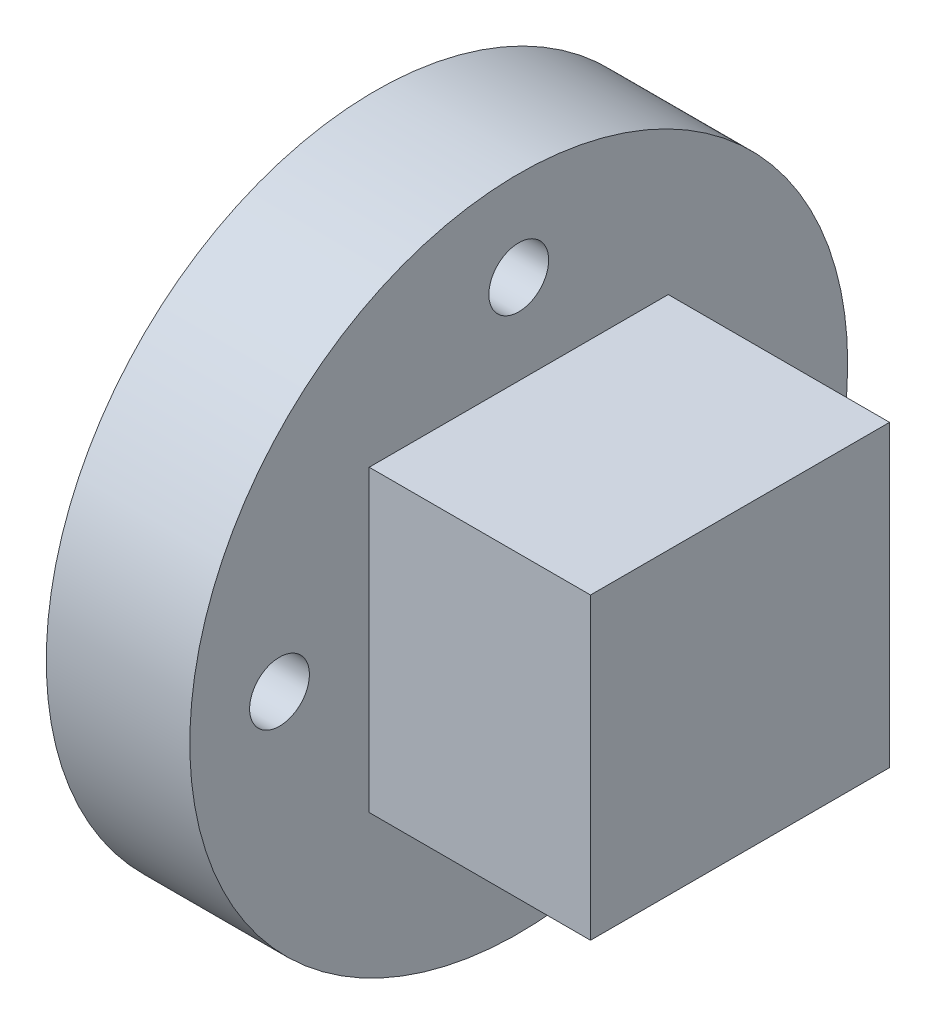
ISO-10303-21;
HEADER;
FILE_DESCRIPTION(('STEP AP214'),'2;1');
FILE_NAME('part.step','',(''),(''),'','','');
FILE_SCHEMA(('AUTOMOTIVE_DESIGN { 1 0 10303 214 1 1 1 1 }'));
ENDSEC;
DATA;
#1=APPLICATION_CONTEXT('core data for automotive mechanical design processes');
#2=APPLICATION_PROTOCOL_DEFINITION('international standard','automotive_design',2000,#1);
#3=PRODUCT_CONTEXT('',#1,'mechanical');
#4=PRODUCT('Part','Part','',(#3));
#5=PRODUCT_RELATED_PRODUCT_CATEGORY('part','',(#4));
#6=PRODUCT_DEFINITION_FORMATION('','',#4);
#7=PRODUCT_DEFINITION_CONTEXT('part definition',#1,'design');
#8=PRODUCT_DEFINITION('design','',#6,#7);
#9=PRODUCT_DEFINITION_SHAPE('','',#8);
#10=(LENGTH_UNIT() NAMED_UNIT(*) SI_UNIT(.MILLI.,.METRE.));
#11=(NAMED_UNIT(*) PLANE_ANGLE_UNIT() SI_UNIT($,.RADIAN.));
#12=(NAMED_UNIT(*) SI_UNIT($,.STERADIAN.) SOLID_ANGLE_UNIT());
#13=UNCERTAINTY_MEASURE_WITH_UNIT(LENGTH_MEASURE(1.E-05),#10,'distance_accuracy_value','');
#14=(GEOMETRIC_REPRESENTATION_CONTEXT(3) GLOBAL_UNCERTAINTY_ASSIGNED_CONTEXT((#13)) GLOBAL_UNIT_ASSIGNED_CONTEXT((#10,
#11,#12)) REPRESENTATION_CONTEXT('',''));
#15=CARTESIAN_POINT('',(0.,0.,0.));
#16=DIRECTION('',(0.,0.,1.));
#17=DIRECTION('',(1.,0.,0.));
#18=AXIS2_PLACEMENT_3D('',#15,#16,#17);
#19=CARTESIAN_POINT('',(6.,4.,0.));
#20=DIRECTION('',(-1.,0.,0.));
#21=DIRECTION('',(0.,0.,1.));
#22=AXIS2_PLACEMENT_3D('',#19,#20,#21);
#23=CYLINDRICAL_SURFACE('',#22,0.5);
#24=CARTESIAN_POINT('',(0.,4.,0.));
#25=DIRECTION('',(1.,0.,0.));
#26=DIRECTION('',(0.,0.,-1.));
#27=AXIS2_PLACEMENT_3D('',#24,#25,#26);
#28=CIRCLE('',#27,0.5);
#29=CARTESIAN_POINT('',(0.,4.,-0.5));
#30=VERTEX_POINT('',#29);
#31=EDGE_CURVE('E183',#30,#30,#28,.T.);
#32=ORIENTED_EDGE('',*,*,#31,.F.);
#33=EDGE_LOOP('',(#32));
#34=FACE_BOUND('',#33,.T.);
#35=CARTESIAN_POINT('',(2.4,4.,0.));
#36=DIRECTION('',(1.,0.,0.));
#37=DIRECTION('',(0.,0.,-1.));
#38=AXIS2_PLACEMENT_3D('',#35,#36,#37);
#39=CIRCLE('',#38,0.5);
#40=CARTESIAN_POINT('',(2.4,4.,-0.5));
#41=VERTEX_POINT('',#40);
#42=EDGE_CURVE('E145',#41,#41,#39,.T.);
#43=ORIENTED_EDGE('',*,*,#42,.T.);
#44=EDGE_LOOP('',(#43));
#45=FACE_BOUND('',#44,.T.);
#46=ADVANCED_FACE('F40',(#34,#45),#23,.F.);
#47=CARTESIAN_POINT('',(6.,1.12952049642128E-13,-4.00000000000011));
#48=DIRECTION('',(-1.,0.,0.));
#49=DIRECTION('',(0.,0.,1.));
#50=AXIS2_PLACEMENT_3D('',#47,#48,#49);
#51=CYLINDRICAL_SURFACE('',#50,0.500000000000089);
#52=CARTESIAN_POINT('',(0.,1.12952049642128E-13,-4.00000000000011));
#53=DIRECTION('',(1.,0.,0.));
#54=DIRECTION('',(0.,0.,-1.));
#55=AXIS2_PLACEMENT_3D('',#52,#53,#54);
#56=CIRCLE('',#55,0.500000000000089);
#57=CARTESIAN_POINT('',(0.,1.12952049642128E-13,-4.5000000000002));
#58=VERTEX_POINT('',#57);
#59=EDGE_CURVE('E179',#58,#58,#56,.T.);
#60=ORIENTED_EDGE('',*,*,#59,.F.);
#61=EDGE_LOOP('',(#60));
#62=FACE_BOUND('',#61,.T.);
#63=CARTESIAN_POINT('',(2.4,1.12952049642128E-13,-4.00000000000011));
#64=DIRECTION('',(1.,0.,0.));
#65=DIRECTION('',(0.,0.,-1.));
#66=AXIS2_PLACEMENT_3D('',#63,#64,#65);
#67=CIRCLE('',#66,0.500000000000089);
#68=CARTESIAN_POINT('',(2.4,1.12952049642128E-13,-4.5000000000002));
#69=VERTEX_POINT('',#68);
#70=EDGE_CURVE('E141',#69,#69,#67,.T.);
#71=ORIENTED_EDGE('',*,*,#70,.T.);
#72=EDGE_LOOP('',(#71));
#73=FACE_BOUND('',#72,.T.);
#74=ADVANCED_FACE('F238',(#62,#73),#51,.F.);
#75=CARTESIAN_POINT('',(6.,-4.,-2.25904099284255E-13));
#76=DIRECTION('',(-1.,0.,0.));
#77=DIRECTION('',(0.,0.,1.));
#78=AXIS2_PLACEMENT_3D('',#75,#76,#77);
#79=CYLINDRICAL_SURFACE('',#78,0.500000000000243);
#80=CARTESIAN_POINT('',(0.,-4.,-2.25904099284255E-13));
#81=DIRECTION('',(1.,0.,0.));
#82=DIRECTION('',(0.,0.,-1.));
#83=AXIS2_PLACEMENT_3D('',#80,#81,#82);
#84=CIRCLE('',#83,0.500000000000243);
#85=CARTESIAN_POINT('',(0.,-4.,-0.500000000000469));
#86=VERTEX_POINT('',#85);
#87=EDGE_CURVE('E175',#86,#86,#84,.T.);
#88=ORIENTED_EDGE('',*,*,#87,.F.);
#89=EDGE_LOOP('',(#88));
#90=FACE_BOUND('',#89,.T.);
#91=CARTESIAN_POINT('',(2.4,-4.,-2.25904099284255E-13));
#92=DIRECTION('',(1.,0.,0.));
#93=DIRECTION('',(0.,0.,-1.));
#94=AXIS2_PLACEMENT_3D('',#91,#92,#93);
#95=CIRCLE('',#94,0.500000000000243);
#96=CARTESIAN_POINT('',(2.4,-4.,-0.500000000000469));
#97=VERTEX_POINT('',#96);
#98=EDGE_CURVE('E137',#97,#97,#95,.T.);
#99=ORIENTED_EDGE('',*,*,#98,.T.);
#100=EDGE_LOOP('',(#99));
#101=FACE_BOUND('',#100,.T.);
#102=ADVANCED_FACE('F219',(#90,#101),#79,.F.);
#103=CARTESIAN_POINT('',(6.,-1.13441908361787E-13,3.99999999999989));
#104=DIRECTION('',(-1.,0.,0.));
#105=DIRECTION('',(0.,0.,1.));
#106=AXIS2_PLACEMENT_3D('',#103,#104,#105);
#107=CYLINDRICAL_SURFACE('',#106,0.500000000000181);
#108=CARTESIAN_POINT('',(0.,-1.13441908361787E-13,3.99999999999989));
#109=DIRECTION('',(1.,0.,0.));
#110=DIRECTION('',(0.,0.,-1.));
#111=AXIS2_PLACEMENT_3D('',#108,#109,#110);
#112=CIRCLE('',#111,0.500000000000181);
#113=CARTESIAN_POINT('',(0.,-1.13441908361787E-13,3.49999999999971));
#114=VERTEX_POINT('',#113);
#115=EDGE_CURVE('E171',#114,#114,#112,.T.);
#116=ORIENTED_EDGE('',*,*,#115,.F.);
#117=EDGE_LOOP('',(#116));
#118=FACE_BOUND('',#117,.T.);
#119=CARTESIAN_POINT('',(2.4,-1.13441908361787E-13,3.99999999999989));
#120=DIRECTION('',(1.,0.,0.));
#121=DIRECTION('',(0.,0.,-1.));
#122=AXIS2_PLACEMENT_3D('',#119,#120,#121);
#123=CIRCLE('',#122,0.500000000000181);
#124=CARTESIAN_POINT('',(2.4,-1.13441908361787E-13,3.49999999999971));
#125=VERTEX_POINT('',#124);
#126=EDGE_CURVE('E133',#125,#125,#123,.T.);
#127=ORIENTED_EDGE('',*,*,#126,.T.);
#128=EDGE_LOOP('',(#127));
#129=FACE_BOUND('',#128,.T.);
#130=ADVANCED_FACE('F216',(#118,#129),#107,.F.);
#131=CARTESIAN_POINT('',(6.,0.,0.));
#132=DIRECTION('',(-1.,0.,0.));
#133=DIRECTION('',(0.,0.,1.));
#134=AXIS2_PLACEMENT_3D('',#131,#132,#133);
#135=CYLINDRICAL_SURFACE('',#134,5.5);
#136=CARTESIAN_POINT('',(0.,0.,0.));
#137=DIRECTION('',(1.,0.,0.));
#138=DIRECTION('',(0.,0.,-1.));
#139=AXIS2_PLACEMENT_3D('',#136,#137,#138);
#140=CIRCLE('',#139,5.5);
#141=CARTESIAN_POINT('',(0.,0.,-5.5));
#142=VERTEX_POINT('',#141);
#143=EDGE_CURVE('E12',#142,#142,#140,.T.);
#144=ORIENTED_EDGE('',*,*,#143,.T.);
#145=EDGE_LOOP('',(#144));
#146=FACE_BOUND('',#145,.T.);
#147=CARTESIAN_POINT('',(2.4,0.,0.));
#148=DIRECTION('',(1.,0.,0.));
#149=DIRECTION('',(0.,0.,-1.));
#150=AXIS2_PLACEMENT_3D('',#147,#148,#149);
#151=CIRCLE('',#150,5.5);
#152=CARTESIAN_POINT('',(2.4,0.,-5.5));
#153=VERTEX_POINT('',#152);
#154=EDGE_CURVE('E44',#153,#153,#151,.T.);
#155=ORIENTED_EDGE('',*,*,#154,.F.);
#156=EDGE_LOOP('',(#155));
#157=FACE_BOUND('',#156,.T.);
#158=ADVANCED_FACE('F42',(#146,#157),#135,.T.);
#159=CARTESIAN_POINT('',(6.,0.,0.));
#160=DIRECTION('',(-1.,0.,0.));
#161=DIRECTION('',(0.,0.,1.));
#162=AXIS2_PLACEMENT_3D('',#159,#160,#161);
#163=CYLINDRICAL_SURFACE('',#162,2.075);
#164=DIRECTION('',(-1.,0.,0.));
#165=VECTOR('',#164,1.);
#166=CARTESIAN_POINT('',(6.,1.6,1.32122102617238));
#167=LINE('',#166,#165);
#168=CARTESIAN_POINT('',(5.,1.6,1.32122102617238));
#169=VERTEX_POINT('',#168);
#170=CARTESIAN_POINT('',(0.,1.6,1.32122102617238));
#171=VERTEX_POINT('',#170);
#172=EDGE_CURVE('E63',#169,#171,#167,.T.);
#173=ORIENTED_EDGE('',*,*,#172,.F.);
#174=CARTESIAN_POINT('',(5.,0.,0.));
#175=DIRECTION('',(1.,0.,0.));
#176=DIRECTION('',(0.,0.,-1.));
#177=AXIS2_PLACEMENT_3D('',#174,#175,#176);
#178=CIRCLE('',#177,2.075);
#179=CARTESIAN_POINT('',(5.,1.6,-1.32122102617238));
#180=VERTEX_POINT('',#179);
#181=EDGE_CURVE('E56',#169,#180,#178,.T.);
#182=ORIENTED_EDGE('',*,*,#181,.T.);
#183=DIRECTION('',(-1.,0.,0.));
#184=VECTOR('',#183,1.);
#185=CARTESIAN_POINT('',(6.,1.6,-1.32122102617238));
#186=LINE('',#185,#184);
#187=CARTESIAN_POINT('',(0.,1.6,-1.32122102617238));
#188=VERTEX_POINT('',#187);
#189=EDGE_CURVE('E50',#180,#188,#186,.T.);
#190=ORIENTED_EDGE('',*,*,#189,.T.);
#191=CARTESIAN_POINT('',(0.,0.,0.));
#192=DIRECTION('',(1.,0.,0.));
#193=DIRECTION('',(0.,0.,-1.));
#194=AXIS2_PLACEMENT_3D('',#191,#192,#193);
#195=CIRCLE('',#194,2.075);
#196=EDGE_CURVE('E187',#171,#188,#195,.T.);
#197=ORIENTED_EDGE('',*,*,#196,.F.);
#198=EDGE_LOOP('',(#173,#182,#190,#197));
#199=FACE_BOUND('',#198,.T.);
#200=ADVANCED_FACE('F200',(#199),#163,.F.);
#201=CARTESIAN_POINT('',(6.,1.6,1.32122102617238));
#202=DIRECTION('',(0.,-1.,0.));
#203=DIRECTION('',(0.,0.,-1.));
#204=AXIS2_PLACEMENT_3D('',#201,#202,#203);
#205=PLANE('',#204);
#206=ORIENTED_EDGE('',*,*,#189,.F.);
#207=DIRECTION('',(0.,0.,1.));
#208=VECTOR('',#207,1.);
#209=CARTESIAN_POINT('',(5.,1.6,1.32122102617238));
#210=LINE('',#209,#208);
#211=EDGE_CURVE('E107',#180,#169,#210,.T.);
#212=ORIENTED_EDGE('',*,*,#211,.T.);
#213=ORIENTED_EDGE('',*,*,#172,.T.);
#214=DIRECTION('',(0.,0.,1.));
#215=VECTOR('',#214,1.);
#216=CARTESIAN_POINT('',(0.,1.6,1.32122102617238));
#217=LINE('',#216,#215);
#218=EDGE_CURVE('E191',#188,#171,#217,.T.);
#219=ORIENTED_EDGE('',*,*,#218,.F.);
#220=EDGE_LOOP('',(#206,#212,#213,#219));
#221=FACE_BOUND('',#220,.T.);
#222=ADVANCED_FACE('F201',(#221),#205,.T.);
#223=CARTESIAN_POINT('',(0.,0.,0.));
#224=DIRECTION('',(1.,0.,0.));
#225=DIRECTION('',(0.,0.,-1.));
#226=AXIS2_PLACEMENT_3D('',#223,#224,#225);
#227=PLANE('',#226);
#228=ORIENTED_EDGE('',*,*,#143,.F.);
#229=EDGE_LOOP('',(#228));
#230=FACE_BOUND('',#229,.T.);
#231=ORIENTED_EDGE('',*,*,#196,.T.);
#232=ORIENTED_EDGE('',*,*,#218,.T.);
#233=EDGE_LOOP('',(#231,#232));
#234=FACE_BOUND('',#233,.T.);
#235=ORIENTED_EDGE('',*,*,#31,.T.);
#236=EDGE_LOOP('',(#235));
#237=FACE_BOUND('',#236,.T.);
#238=ORIENTED_EDGE('',*,*,#59,.T.);
#239=EDGE_LOOP('',(#238));
#240=FACE_BOUND('',#239,.T.);
#241=ORIENTED_EDGE('',*,*,#87,.T.);
#242=EDGE_LOOP('',(#241));
#243=FACE_BOUND('',#242,.T.);
#244=ORIENTED_EDGE('',*,*,#115,.T.);
#245=EDGE_LOOP('',(#244));
#246=FACE_BOUND('',#245,.T.);
#247=ADVANCED_FACE('F203',(#230,#234,#237,#240,#243,#246),#227,.F.);
#248=CARTESIAN_POINT('',(5.,0.,0.));
#249=DIRECTION('',(1.,0.,0.));
#250=DIRECTION('',(0.,0.,-1.));
#251=AXIS2_PLACEMENT_3D('',#248,#249,#250);
#252=PLANE('',#251);
#253=ORIENTED_EDGE('',*,*,#181,.F.);
#254=ORIENTED_EDGE('',*,*,#211,.F.);
#255=EDGE_LOOP('',(#253,#254));
#256=FACE_BOUND('',#255,.T.);
#257=ADVANCED_FACE('F206',(#256),#252,.F.);
#258=CARTESIAN_POINT('',(2.4,0.,0.));
#259=DIRECTION('',(1.,0.,0.));
#260=DIRECTION('',(0.,0.,-1.));
#261=AXIS2_PLACEMENT_3D('',#258,#259,#260);
#262=PLANE('',#261);
#263=ORIENTED_EDGE('',*,*,#42,.F.);
#264=EDGE_LOOP('',(#263));
#265=FACE_BOUND('',#264,.T.);
#266=ORIENTED_EDGE('',*,*,#70,.F.);
#267=EDGE_LOOP('',(#266));
#268=FACE_BOUND('',#267,.T.);
#269=ORIENTED_EDGE('',*,*,#98,.F.);
#270=EDGE_LOOP('',(#269));
#271=FACE_BOUND('',#270,.T.);
#272=ORIENTED_EDGE('',*,*,#126,.F.);
#273=EDGE_LOOP('',(#272));
#274=FACE_BOUND('',#273,.T.);
#275=DIRECTION('',(0.,0.,1.));
#276=VECTOR('',#275,1.);
#277=CARTESIAN_POINT('',(2.4,2.5,2.5));
#278=LINE('',#277,#276);
#279=CARTESIAN_POINT('',(2.4,2.5,-2.5));
#280=VERTEX_POINT('',#279);
#281=CARTESIAN_POINT('',(2.4,2.5,2.5));
#282=VERTEX_POINT('',#281);
#283=EDGE_CURVE('E130',#280,#282,#278,.T.);
#284=ORIENTED_EDGE('',*,*,#283,.F.);
#285=DIRECTION('',(0.,1.,0.));
#286=VECTOR('',#285,1.);
#287=CARTESIAN_POINT('',(2.4,2.5,-2.5));
#288=LINE('',#287,#286);
#289=CARTESIAN_POINT('',(2.4,-2.5,-2.5));
#290=VERTEX_POINT('',#289);
#291=EDGE_CURVE('E119',#290,#280,#288,.T.);
#292=ORIENTED_EDGE('',*,*,#291,.F.);
#293=DIRECTION('',(0.,0.,-1.));
#294=VECTOR('',#293,1.);
#295=CARTESIAN_POINT('',(2.4,-2.5,2.5));
#296=LINE('',#295,#294);
#297=CARTESIAN_POINT('',(2.4,-2.5,2.5));
#298=VERTEX_POINT('',#297);
#299=EDGE_CURVE('E100',#298,#290,#296,.T.);
#300=ORIENTED_EDGE('',*,*,#299,.F.);
#301=DIRECTION('',(0.,-1.,0.));
#302=VECTOR('',#301,1.);
#303=CARTESIAN_POINT('',(2.4,2.5,2.5));
#304=LINE('',#303,#302);
#305=EDGE_CURVE('E116',#282,#298,#304,.T.);
#306=ORIENTED_EDGE('',*,*,#305,.F.);
#307=EDGE_LOOP('',(#284,#292,#300,#306));
#308=FACE_BOUND('',#307,.T.);
#309=ORIENTED_EDGE('',*,*,#154,.T.);
#310=EDGE_LOOP('',(#309));
#311=FACE_BOUND('',#310,.T.);
#312=ADVANCED_FACE('F114',(#265,#268,#271,#274,#308,#311),#262,.T.);
#313=CARTESIAN_POINT('',(6.1,0.,0.));
#314=DIRECTION('',(1.,0.,0.));
#315=DIRECTION('',(0.,0.,-1.));
#316=AXIS2_PLACEMENT_3D('',#313,#314,#315);
#317=PLANE('',#316);
#318=DIRECTION('',(0.,-1.,0.));
#319=VECTOR('',#318,1.);
#320=CARTESIAN_POINT('',(6.1,2.5,2.5));
#321=LINE('',#320,#319);
#322=CARTESIAN_POINT('',(6.1,2.5,2.5));
#323=VERTEX_POINT('',#322);
#324=CARTESIAN_POINT('',(6.1,-2.5,2.5));
#325=VERTEX_POINT('',#324);
#326=EDGE_CURVE('E149',#323,#325,#321,.T.);
#327=ORIENTED_EDGE('',*,*,#326,.T.);
#328=DIRECTION('',(0.,0.,-1.));
#329=VECTOR('',#328,1.);
#330=CARTESIAN_POINT('',(6.1,-2.5,2.5));
#331=LINE('',#330,#329);
#332=CARTESIAN_POINT('',(6.1,-2.5,-2.5));
#333=VERTEX_POINT('',#332);
#334=EDGE_CURVE('E101',#325,#333,#331,.T.);
#335=ORIENTED_EDGE('',*,*,#334,.T.);
#336=DIRECTION('',(0.,1.,0.));
#337=VECTOR('',#336,1.);
#338=CARTESIAN_POINT('',(6.1,2.5,-2.5));
#339=LINE('',#338,#337);
#340=CARTESIAN_POINT('',(6.1,2.5,-2.5));
#341=VERTEX_POINT('',#340);
#342=EDGE_CURVE('E154',#333,#341,#339,.T.);
#343=ORIENTED_EDGE('',*,*,#342,.T.);
#344=DIRECTION('',(0.,0.,1.));
#345=VECTOR('',#344,1.);
#346=CARTESIAN_POINT('',(6.1,2.5,2.5));
#347=LINE('',#346,#345);
#348=EDGE_CURVE('E157',#341,#323,#347,.T.);
#349=ORIENTED_EDGE('',*,*,#348,.T.);
#350=EDGE_LOOP('',(#327,#335,#343,#349));
#351=FACE_BOUND('',#350,.T.);
#352=ADVANCED_FACE('F224',(#351),#317,.T.);
#353=CARTESIAN_POINT('',(6.1,2.5,2.5));
#354=DIRECTION('',(0.,-1.,0.));
#355=DIRECTION('',(0.,0.,-1.));
#356=AXIS2_PLACEMENT_3D('',#353,#354,#355);
#357=PLANE('',#356);
#358=DIRECTION('',(-1.,0.,0.));
#359=VECTOR('',#358,1.);
#360=CARTESIAN_POINT('',(6.1,2.5,-2.5));
#361=LINE('',#360,#359);
#362=EDGE_CURVE('E162',#341,#280,#361,.T.);
#363=ORIENTED_EDGE('',*,*,#362,.T.);
#364=ORIENTED_EDGE('',*,*,#283,.T.);
#365=DIRECTION('',(-1.,0.,0.));
#366=VECTOR('',#365,1.);
#367=CARTESIAN_POINT('',(6.1,2.5,2.5));
#368=LINE('',#367,#366);
#369=EDGE_CURVE('E124',#323,#282,#368,.T.);
#370=ORIENTED_EDGE('',*,*,#369,.F.);
#371=ORIENTED_EDGE('',*,*,#348,.F.);
#372=EDGE_LOOP('',(#363,#364,#370,#371));
#373=FACE_BOUND('',#372,.T.);
#374=ADVANCED_FACE('F231',(#373),#357,.F.);
#375=CARTESIAN_POINT('',(6.1,2.5,-2.5));
#376=DIRECTION('',(0.,0.,1.));
#377=DIRECTION('',(0.,-1.,0.));
#378=AXIS2_PLACEMENT_3D('',#375,#376,#377);
#379=PLANE('',#378);
#380=DIRECTION('',(-1.,0.,0.));
#381=VECTOR('',#380,1.);
#382=CARTESIAN_POINT('',(6.1,-2.5,-2.5));
#383=LINE('',#382,#381);
#384=EDGE_CURVE('E108',#333,#290,#383,.T.);
#385=ORIENTED_EDGE('',*,*,#384,.T.);
#386=ORIENTED_EDGE('',*,*,#291,.T.);
#387=ORIENTED_EDGE('',*,*,#362,.F.);
#388=ORIENTED_EDGE('',*,*,#342,.F.);
#389=EDGE_LOOP('',(#385,#386,#387,#388));
#390=FACE_BOUND('',#389,.T.);
#391=ADVANCED_FACE('F333',(#390),#379,.F.);
#392=CARTESIAN_POINT('',(6.1,-2.5,2.5));
#393=DIRECTION('',(0.,1.,0.));
#394=DIRECTION('',(0.,0.,1.));
#395=AXIS2_PLACEMENT_3D('',#392,#393,#394);
#396=PLANE('',#395);
#397=DIRECTION('',(-1.,0.,0.));
#398=VECTOR('',#397,1.);
#399=CARTESIAN_POINT('',(6.1,-2.5,2.5));
#400=LINE('',#399,#398);
#401=EDGE_CURVE('E96',#325,#298,#400,.T.);
#402=ORIENTED_EDGE('',*,*,#401,.T.);
#403=ORIENTED_EDGE('',*,*,#299,.T.);
#404=ORIENTED_EDGE('',*,*,#384,.F.);
#405=ORIENTED_EDGE('',*,*,#334,.F.);
#406=EDGE_LOOP('',(#402,#403,#404,#405));
#407=FACE_BOUND('',#406,.T.);
#408=ADVANCED_FACE('F98',(#407),#396,.F.);
#409=CARTESIAN_POINT('',(6.1,2.5,2.5));
#410=DIRECTION('',(0.,0.,-1.));
#411=DIRECTION('',(0.,1.,0.));
#412=AXIS2_PLACEMENT_3D('',#409,#410,#411);
#413=PLANE('',#412);
#414=ORIENTED_EDGE('',*,*,#369,.T.);
#415=ORIENTED_EDGE('',*,*,#305,.T.);
#416=ORIENTED_EDGE('',*,*,#401,.F.);
#417=ORIENTED_EDGE('',*,*,#326,.F.);
#418=EDGE_LOOP('',(#414,#415,#416,#417));
#419=FACE_BOUND('',#418,.T.);
#420=ADVANCED_FACE('F122',(#419),#413,.F.);
#421=CLOSED_SHELL('',(#46,#74,#102,#130,#158,#200,#222,#247,#257,#312,#352,#374,#391,#408,#420));
#422=MANIFOLD_SOLID_BREP('B2',#421);
#423=ADVANCED_BREP_SHAPE_REPRESENTATION('',(#18,#422),#14);
#424=SHAPE_DEFINITION_REPRESENTATION(#9,#423);
ENDSEC;
END-ISO-10303-21;
